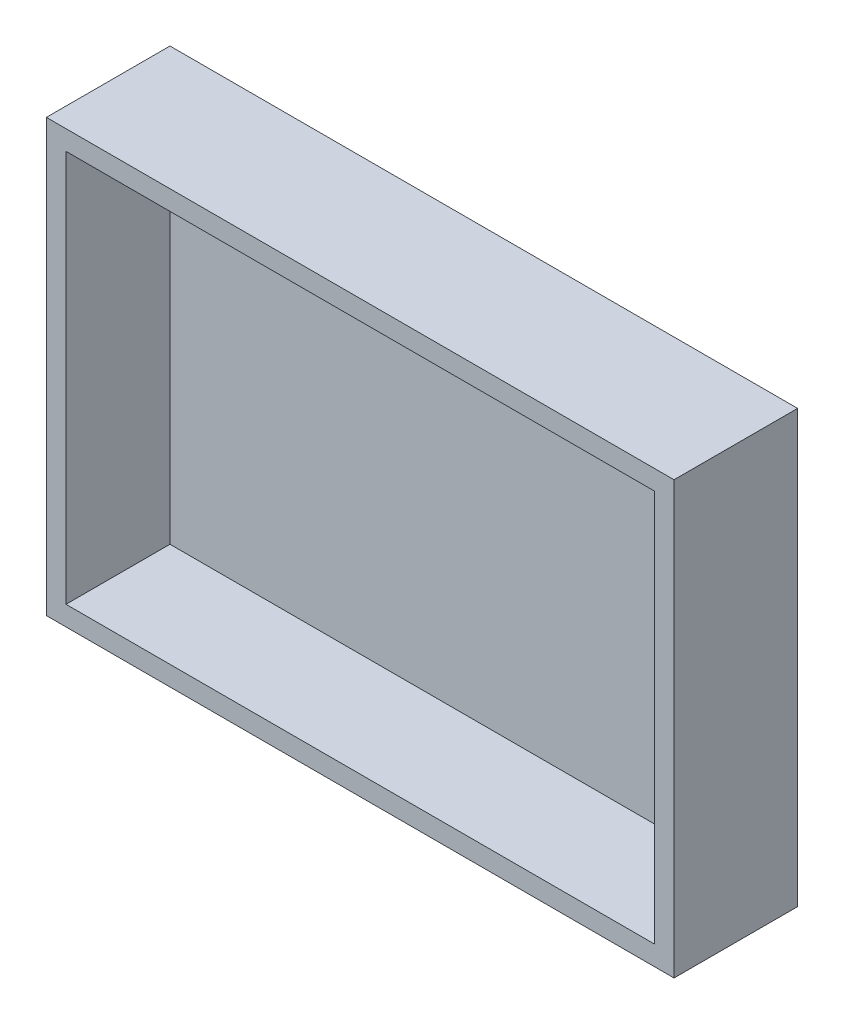
ISO-10303-21;
HEADER;
FILE_DESCRIPTION(('STEP AP214'),'2;1');
FILE_NAME('part.step','',(''),(''),'','','');
FILE_SCHEMA(('AUTOMOTIVE_DESIGN { 1 0 10303 214 1 1 1 1 }'));
ENDSEC;
DATA;
#1=APPLICATION_CONTEXT('core data for automotive mechanical design processes');
#2=APPLICATION_PROTOCOL_DEFINITION('international standard','automotive_design',2000,#1);
#3=PRODUCT_CONTEXT('',#1,'mechanical');
#4=PRODUCT('Part','Part','',(#3));
#5=PRODUCT_RELATED_PRODUCT_CATEGORY('part','',(#4));
#6=PRODUCT_DEFINITION_FORMATION('','',#4);
#7=PRODUCT_DEFINITION_CONTEXT('part definition',#1,'design');
#8=PRODUCT_DEFINITION('design','',#6,#7);
#9=PRODUCT_DEFINITION_SHAPE('','',#8);
#10=(LENGTH_UNIT() NAMED_UNIT(*) SI_UNIT(.MILLI.,.METRE.));
#11=(NAMED_UNIT(*) PLANE_ANGLE_UNIT() SI_UNIT($,.RADIAN.));
#12=(NAMED_UNIT(*) SI_UNIT($,.STERADIAN.) SOLID_ANGLE_UNIT());
#13=UNCERTAINTY_MEASURE_WITH_UNIT(LENGTH_MEASURE(1.E-05),#10,'distance_accuracy_value','');
#14=(GEOMETRIC_REPRESENTATION_CONTEXT(3) GLOBAL_UNCERTAINTY_ASSIGNED_CONTEXT((#13)) GLOBAL_UNIT_ASSIGNED_CONTEXT((#10,
#11,#12)) REPRESENTATION_CONTEXT('',''));
#15=CARTESIAN_POINT('',(0.,0.,0.));
#16=DIRECTION('',(0.,0.,1.));
#17=DIRECTION('',(1.,0.,0.));
#18=AXIS2_PLACEMENT_3D('',#15,#16,#17);
#19=CARTESIAN_POINT('',(0.,0.,5.));
#20=DIRECTION('',(0.,0.,1.));
#21=DIRECTION('',(1.,0.,0.));
#22=AXIS2_PLACEMENT_3D('',#19,#20,#21);
#23=PLANE('',#22);
#24=DIRECTION('',(0.,-1.,0.));
#25=VECTOR('',#24,1.);
#26=CARTESIAN_POINT('',(-75.,-50.,5.));
#27=LINE('',#26,#25);
#28=CARTESIAN_POINT('',(-75.,50.,5.));
#29=VERTEX_POINT('',#28);
#30=CARTESIAN_POINT('',(-75.,-50.,5.));
#31=VERTEX_POINT('',#30);
#32=EDGE_CURVE('E159',#29,#31,#27,.T.);
#33=ORIENTED_EDGE('',*,*,#32,.T.);
#34=DIRECTION('',(1.,0.,0.));
#35=VECTOR('',#34,1.);
#36=CARTESIAN_POINT('',(75.,-50.,5.));
#37=LINE('',#36,#35);
#38=CARTESIAN_POINT('',(75.,-50.,5.));
#39=VERTEX_POINT('',#38);
#40=EDGE_CURVE('E167',#31,#39,#37,.T.);
#41=ORIENTED_EDGE('',*,*,#40,.T.);
#42=DIRECTION('',(0.,1.,0.));
#43=VECTOR('',#42,1.);
#44=CARTESIAN_POINT('',(75.,-50.,5.));
#45=LINE('',#44,#43);
#46=CARTESIAN_POINT('',(75.,50.,5.));
#47=VERTEX_POINT('',#46);
#48=EDGE_CURVE('E45',#39,#47,#45,.T.);
#49=ORIENTED_EDGE('',*,*,#48,.T.);
#50=DIRECTION('',(-1.,0.,0.));
#51=VECTOR('',#50,1.);
#52=CARTESIAN_POINT('',(75.,50.,5.));
#53=LINE('',#52,#51);
#54=EDGE_CURVE('E11',#47,#29,#53,.T.);
#55=ORIENTED_EDGE('',*,*,#54,.T.);
#56=EDGE_LOOP('',(#33,#41,#49,#55));
#57=FACE_BOUND('',#56,.T.);
#58=ADVANCED_FACE('F37',(#57),#23,.T.);
#59=CARTESIAN_POINT('',(0.,0.,0.));
#60=DIRECTION('',(0.,0.,1.));
#61=DIRECTION('',(1.,0.,0.));
#62=AXIS2_PLACEMENT_3D('',#59,#60,#61);
#63=PLANE('',#62);
#64=DIRECTION('',(1.,0.,0.));
#65=VECTOR('',#64,1.);
#66=CARTESIAN_POINT('',(-75.,-55.,0.));
#67=LINE('',#66,#65);
#68=CARTESIAN_POINT('',(-80.,-55.,0.));
#69=VERTEX_POINT('',#68);
#70=CARTESIAN_POINT('',(80.,-55.,0.));
#71=VERTEX_POINT('',#70);
#72=EDGE_CURVE('E100',#69,#71,#67,.T.);
#73=ORIENTED_EDGE('',*,*,#72,.F.);
#74=DIRECTION('',(0.,-1.,0.));
#75=VECTOR('',#74,1.);
#76=CARTESIAN_POINT('',(-80.,55.,0.));
#77=LINE('',#76,#75);
#78=CARTESIAN_POINT('',(-80.,55.,0.));
#79=VERTEX_POINT('',#78);
#80=EDGE_CURVE('E104',#79,#69,#77,.T.);
#81=ORIENTED_EDGE('',*,*,#80,.F.);
#82=DIRECTION('',(-1.,0.,0.));
#83=VECTOR('',#82,1.);
#84=CARTESIAN_POINT('',(-75.,55.,0.));
#85=LINE('',#84,#83);
#86=CARTESIAN_POINT('',(80.,55.,0.));
#87=VERTEX_POINT('',#86);
#88=EDGE_CURVE('E139',#87,#79,#85,.T.);
#89=ORIENTED_EDGE('',*,*,#88,.F.);
#90=DIRECTION('',(0.,1.,0.));
#91=VECTOR('',#90,1.);
#92=CARTESIAN_POINT('',(80.,50.,0.));
#93=LINE('',#92,#91);
#94=EDGE_CURVE('E105',#71,#87,#93,.T.);
#95=ORIENTED_EDGE('',*,*,#94,.F.);
#96=EDGE_LOOP('',(#73,#81,#89,#95));
#97=FACE_BOUND('',#96,.T.);
#98=ADVANCED_FACE('F39',(#97),#63,.F.);
#99=CARTESIAN_POINT('',(0.,-50.,0.));
#100=DIRECTION('',(0.,1.,0.));
#101=DIRECTION('',(-1.,0.,0.));
#102=AXIS2_PLACEMENT_3D('',#99,#100,#101);
#103=PLANE('',#102);
#104=ORIENTED_EDGE('',*,*,#40,.F.);
#105=DIRECTION('',(0.,0.,-1.));
#106=VECTOR('',#105,1.);
#107=CARTESIAN_POINT('',(-75.,-50.,0.));
#108=LINE('',#107,#106);
#109=CARTESIAN_POINT('',(-75.,-50.,31.5067842044044));
#110=VERTEX_POINT('',#109);
#111=EDGE_CURVE('E153',#110,#31,#108,.T.);
#112=ORIENTED_EDGE('',*,*,#111,.F.);
#113=DIRECTION('',(-1.,0.,0.));
#114=VECTOR('',#113,1.);
#115=CARTESIAN_POINT('',(-75.,-50.,31.5067842044044));
#116=LINE('',#115,#114);
#117=CARTESIAN_POINT('',(75.,-50.,31.5067842044044));
#118=VERTEX_POINT('',#117);
#119=EDGE_CURVE('E110',#118,#110,#116,.T.);
#120=ORIENTED_EDGE('',*,*,#119,.F.);
#121=DIRECTION('',(0.,0.,1.));
#122=VECTOR('',#121,1.);
#123=CARTESIAN_POINT('',(75.,-50.,0.));
#124=LINE('',#123,#122);
#125=EDGE_CURVE('E162',#39,#118,#124,.T.);
#126=ORIENTED_EDGE('',*,*,#125,.F.);
#127=EDGE_LOOP('',(#104,#112,#120,#126));
#128=FACE_BOUND('',#127,.T.);
#129=ADVANCED_FACE('F178',(#128),#103,.T.);
#130=CARTESIAN_POINT('',(-75.,-55.,31.5067842044044));
#131=DIRECTION('',(0.,0.,-1.));
#132=DIRECTION('',(-1.,0.,0.));
#133=AXIS2_PLACEMENT_3D('',#130,#131,#132);
#134=PLANE('',#133);
#135=ORIENTED_EDGE('',*,*,#119,.T.);
#136=DIRECTION('',(0.,1.,0.));
#137=VECTOR('',#136,1.);
#138=CARTESIAN_POINT('',(-75.,55.,31.5067842044044));
#139=LINE('',#138,#137);
#140=CARTESIAN_POINT('',(-75.,50.,31.5067842044044));
#141=VERTEX_POINT('',#140);
#142=EDGE_CURVE('E124',#110,#141,#139,.T.);
#143=ORIENTED_EDGE('',*,*,#142,.T.);
#144=DIRECTION('',(1.,0.,0.));
#145=VECTOR('',#144,1.);
#146=CARTESIAN_POINT('',(-75.,50.,31.5067842044044));
#147=LINE('',#146,#145);
#148=CARTESIAN_POINT('',(75.,50.,31.5067842044044));
#149=VERTEX_POINT('',#148);
#150=EDGE_CURVE('E136',#141,#149,#147,.T.);
#151=ORIENTED_EDGE('',*,*,#150,.T.);
#152=DIRECTION('',(0.,-1.,0.));
#153=VECTOR('',#152,1.);
#154=CARTESIAN_POINT('',(75.,50.,31.5067842044044));
#155=LINE('',#154,#153);
#156=EDGE_CURVE('E148',#149,#118,#155,.T.);
#157=ORIENTED_EDGE('',*,*,#156,.T.);
#158=EDGE_LOOP('',(#135,#143,#151,#157));
#159=FACE_BOUND('',#158,.T.);
#160=DIRECTION('',(0.,1.,0.));
#161=VECTOR('',#160,1.);
#162=CARTESIAN_POINT('',(-80.,55.,31.5067842044044));
#163=LINE('',#162,#161);
#164=CARTESIAN_POINT('',(-80.,-55.,31.5067842044044));
#165=VERTEX_POINT('',#164);
#166=CARTESIAN_POINT('',(-80.,55.,31.5067842044044));
#167=VERTEX_POINT('',#166);
#168=EDGE_CURVE('E118',#165,#167,#163,.T.);
#169=ORIENTED_EDGE('',*,*,#168,.F.);
#170=DIRECTION('',(-1.,0.,0.));
#171=VECTOR('',#170,1.);
#172=CARTESIAN_POINT('',(-75.,-55.,31.5067842044044));
#173=LINE('',#172,#171);
#174=CARTESIAN_POINT('',(80.,-55.,31.5067842044044));
#175=VERTEX_POINT('',#174);
#176=EDGE_CURVE('E109',#175,#165,#173,.T.);
#177=ORIENTED_EDGE('',*,*,#176,.F.);
#178=DIRECTION('',(0.,-1.,0.));
#179=VECTOR('',#178,1.);
#180=CARTESIAN_POINT('',(80.,50.,31.5067842044044));
#181=LINE('',#180,#179);
#182=CARTESIAN_POINT('',(80.,55.,31.5067842044044));
#183=VERTEX_POINT('',#182);
#184=EDGE_CURVE('E147',#183,#175,#181,.T.);
#185=ORIENTED_EDGE('',*,*,#184,.F.);
#186=DIRECTION('',(1.,0.,0.));
#187=VECTOR('',#186,1.);
#188=CARTESIAN_POINT('',(-75.,55.,31.5067842044044));
#189=LINE('',#188,#187);
#190=EDGE_CURVE('E132',#167,#183,#189,.T.);
#191=ORIENTED_EDGE('',*,*,#190,.F.);
#192=EDGE_LOOP('',(#169,#177,#185,#191));
#193=FACE_BOUND('',#192,.T.);
#194=ADVANCED_FACE('F180',(#159,#193),#134,.F.);
#195=CARTESIAN_POINT('',(0.,-55.,0.));
#196=DIRECTION('',(0.,1.,0.));
#197=DIRECTION('',(-1.,0.,0.));
#198=AXIS2_PLACEMENT_3D('',#195,#196,#197);
#199=PLANE('',#198);
#200=ORIENTED_EDGE('',*,*,#176,.T.);
#201=DIRECTION('',(0.,0.,1.));
#202=VECTOR('',#201,1.);
#203=CARTESIAN_POINT('',(-80.,-55.,0.));
#204=LINE('',#203,#202);
#205=EDGE_CURVE('E113',#69,#165,#204,.T.);
#206=ORIENTED_EDGE('',*,*,#205,.F.);
#207=ORIENTED_EDGE('',*,*,#72,.T.);
#208=DIRECTION('',(0.,0.,-1.));
#209=VECTOR('',#208,1.);
#210=CARTESIAN_POINT('',(80.,-55.,0.));
#211=LINE('',#210,#209);
#212=EDGE_CURVE('E151',#175,#71,#211,.T.);
#213=ORIENTED_EDGE('',*,*,#212,.F.);
#214=EDGE_LOOP('',(#200,#206,#207,#213));
#215=FACE_BOUND('',#214,.T.);
#216=ADVANCED_FACE('F114',(#215),#199,.F.);
#217=CARTESIAN_POINT('',(75.,0.,0.));
#218=DIRECTION('',(-1.,0.,0.));
#219=DIRECTION('',(0.,0.,1.));
#220=AXIS2_PLACEMENT_3D('',#217,#218,#219);
#221=PLANE('',#220);
#222=ORIENTED_EDGE('',*,*,#48,.F.);
#223=ORIENTED_EDGE('',*,*,#125,.T.);
#224=ORIENTED_EDGE('',*,*,#156,.F.);
#225=DIRECTION('',(0.,0.,1.));
#226=VECTOR('',#225,1.);
#227=CARTESIAN_POINT('',(75.,50.,0.));
#228=LINE('',#227,#226);
#229=EDGE_CURVE('E141',#47,#149,#228,.T.);
#230=ORIENTED_EDGE('',*,*,#229,.F.);
#231=EDGE_LOOP('',(#222,#223,#224,#230));
#232=FACE_BOUND('',#231,.T.);
#233=ADVANCED_FACE('F172',(#232),#221,.T.);
#234=CARTESIAN_POINT('',(80.,0.,0.));
#235=DIRECTION('',(-1.,0.,0.));
#236=DIRECTION('',(0.,0.,1.));
#237=AXIS2_PLACEMENT_3D('',#234,#235,#236);
#238=PLANE('',#237);
#239=ORIENTED_EDGE('',*,*,#94,.T.);
#240=DIRECTION('',(0.,0.,-1.));
#241=VECTOR('',#240,1.);
#242=CARTESIAN_POINT('',(80.,55.,0.));
#243=LINE('',#242,#241);
#244=EDGE_CURVE('E135',#183,#87,#243,.T.);
#245=ORIENTED_EDGE('',*,*,#244,.F.);
#246=ORIENTED_EDGE('',*,*,#184,.T.);
#247=ORIENTED_EDGE('',*,*,#212,.T.);
#248=EDGE_LOOP('',(#239,#245,#246,#247));
#249=FACE_BOUND('',#248,.T.);
#250=ADVANCED_FACE('F188',(#249),#238,.F.);
#251=CARTESIAN_POINT('',(0.,55.,0.));
#252=DIRECTION('',(0.,1.,0.));
#253=DIRECTION('',(-1.,0.,0.));
#254=AXIS2_PLACEMENT_3D('',#251,#252,#253);
#255=PLANE('',#254);
#256=ORIENTED_EDGE('',*,*,#88,.T.);
#257=DIRECTION('',(0.,0.,-1.));
#258=VECTOR('',#257,1.);
#259=CARTESIAN_POINT('',(-80.,55.,0.));
#260=LINE('',#259,#258);
#261=EDGE_CURVE('E123',#167,#79,#260,.T.);
#262=ORIENTED_EDGE('',*,*,#261,.F.);
#263=ORIENTED_EDGE('',*,*,#190,.T.);
#264=ORIENTED_EDGE('',*,*,#244,.T.);
#265=EDGE_LOOP('',(#256,#262,#263,#264));
#266=FACE_BOUND('',#265,.T.);
#267=ADVANCED_FACE('F185',(#266),#255,.T.);
#268=CARTESIAN_POINT('',(0.,50.,0.));
#269=DIRECTION('',(0.,1.,0.));
#270=DIRECTION('',(-1.,0.,0.));
#271=AXIS2_PLACEMENT_3D('',#268,#269,#270);
#272=PLANE('',#271);
#273=ORIENTED_EDGE('',*,*,#54,.F.);
#274=ORIENTED_EDGE('',*,*,#229,.T.);
#275=ORIENTED_EDGE('',*,*,#150,.F.);
#276=DIRECTION('',(0.,0.,1.));
#277=VECTOR('',#276,1.);
#278=CARTESIAN_POINT('',(-75.,50.,0.));
#279=LINE('',#278,#277);
#280=EDGE_CURVE('E130',#29,#141,#279,.T.);
#281=ORIENTED_EDGE('',*,*,#280,.F.);
#282=EDGE_LOOP('',(#273,#274,#275,#281));
#283=FACE_BOUND('',#282,.T.);
#284=ADVANCED_FACE('F174',(#283),#272,.F.);
#285=CARTESIAN_POINT('',(-75.,0.,0.));
#286=DIRECTION('',(-1.,0.,0.));
#287=DIRECTION('',(0.,0.,1.));
#288=AXIS2_PLACEMENT_3D('',#285,#286,#287);
#289=PLANE('',#288);
#290=ORIENTED_EDGE('',*,*,#142,.F.);
#291=ORIENTED_EDGE('',*,*,#111,.T.);
#292=ORIENTED_EDGE('',*,*,#32,.F.);
#293=ORIENTED_EDGE('',*,*,#280,.T.);
#294=EDGE_LOOP('',(#290,#291,#292,#293));
#295=FACE_BOUND('',#294,.T.);
#296=ADVANCED_FACE('F177',(#295),#289,.F.);
#297=CARTESIAN_POINT('',(-80.,0.,0.));
#298=DIRECTION('',(-1.,0.,0.));
#299=DIRECTION('',(0.,0.,1.));
#300=AXIS2_PLACEMENT_3D('',#297,#298,#299);
#301=PLANE('',#300);
#302=ORIENTED_EDGE('',*,*,#80,.T.);
#303=ORIENTED_EDGE('',*,*,#205,.T.);
#304=ORIENTED_EDGE('',*,*,#168,.T.);
#305=ORIENTED_EDGE('',*,*,#261,.T.);
#306=EDGE_LOOP('',(#302,#303,#304,#305));
#307=FACE_BOUND('',#306,.T.);
#308=ADVANCED_FACE('F121',(#307),#301,.T.);
#309=CLOSED_SHELL('',(#58,#98,#129,#194,#216,#233,#250,#267,#284,#296,#308));
#310=MANIFOLD_SOLID_BREP('B2',#309);
#311=ADVANCED_BREP_SHAPE_REPRESENTATION('',(#18,#310),#14);
#312=SHAPE_DEFINITION_REPRESENTATION(#9,#311);
ENDSEC;
END-ISO-10303-21;
